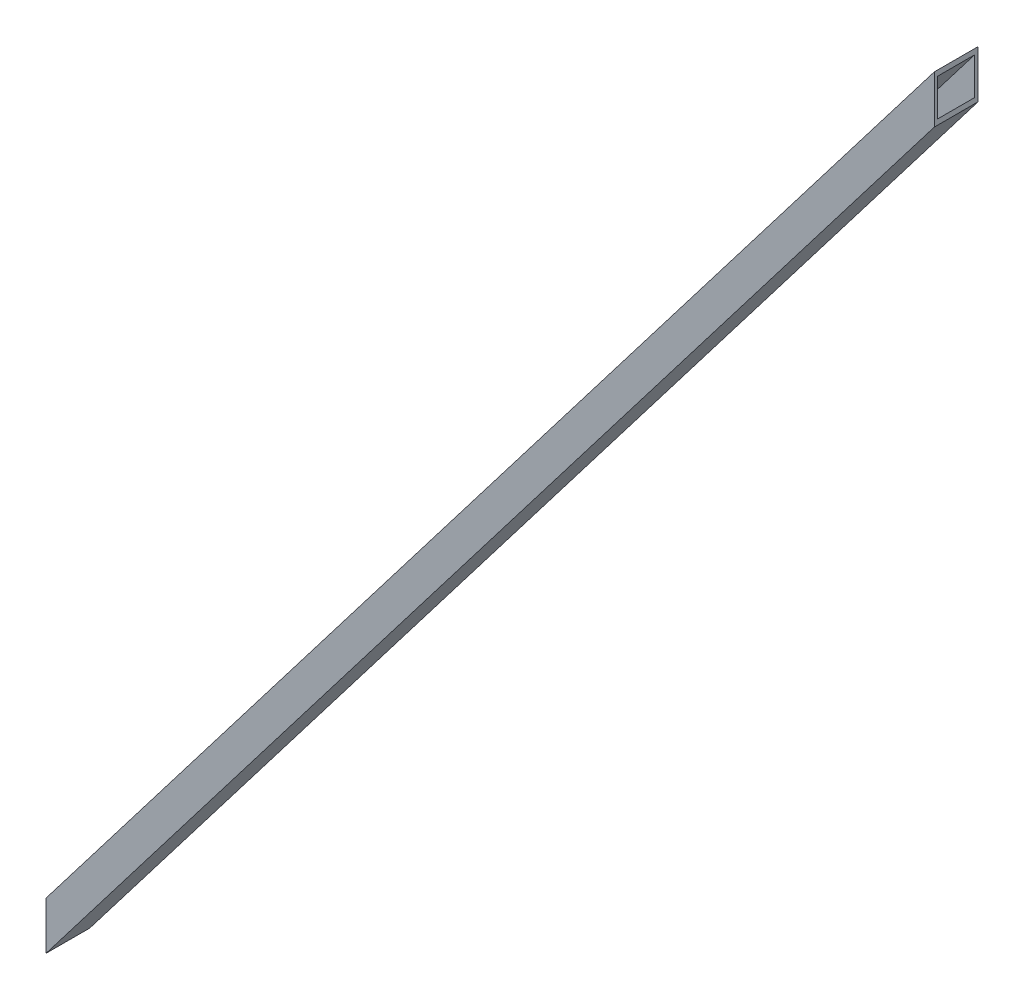
ISO-10303-21;
HEADER;
FILE_DESCRIPTION(('STEP AP214'),'2;1');
FILE_NAME('part.step','',(''),(''),'','','');
FILE_SCHEMA(('AUTOMOTIVE_DESIGN { 1 0 10303 214 1 1 1 1 }'));
ENDSEC;
DATA;
#1=APPLICATION_CONTEXT('core data for automotive mechanical design processes');
#2=APPLICATION_PROTOCOL_DEFINITION('international standard','automotive_design',2000,#1);
#3=PRODUCT_CONTEXT('',#1,'mechanical');
#4=PRODUCT('Part','Part','',(#3));
#5=PRODUCT_RELATED_PRODUCT_CATEGORY('part','',(#4));
#6=PRODUCT_DEFINITION_FORMATION('','',#4);
#7=PRODUCT_DEFINITION_CONTEXT('part definition',#1,'design');
#8=PRODUCT_DEFINITION('design','',#6,#7);
#9=PRODUCT_DEFINITION_SHAPE('','',#8);
#10=(LENGTH_UNIT() NAMED_UNIT(*) SI_UNIT(.MILLI.,.METRE.));
#11=(NAMED_UNIT(*) PLANE_ANGLE_UNIT() SI_UNIT($,.RADIAN.));
#12=(NAMED_UNIT(*) SI_UNIT($,.STERADIAN.) SOLID_ANGLE_UNIT());
#13=UNCERTAINTY_MEASURE_WITH_UNIT(LENGTH_MEASURE(1.E-05),#10,'distance_accuracy_value','');
#14=(GEOMETRIC_REPRESENTATION_CONTEXT(3) GLOBAL_UNCERTAINTY_ASSIGNED_CONTEXT((#13)) GLOBAL_UNIT_ASSIGNED_CONTEXT((#10,
#11,#12)) REPRESENTATION_CONTEXT('',''));
#15=CARTESIAN_POINT('',(0.,0.,0.));
#16=DIRECTION('',(0.,0.,1.));
#17=DIRECTION('',(1.,0.,0.));
#18=AXIS2_PLACEMENT_3D('',#15,#16,#17);
#19=CARTESIAN_POINT('',(0.,0.,0.));
#20=DIRECTION('',(1.,0.,0.));
#21=DIRECTION('',(0.,0.,-1.));
#22=AXIS2_PLACEMENT_3D('',#19,#20,#21);
#23=PLANE('',#22);
#24=DIRECTION('',(0.,-1.,0.));
#25=VECTOR('',#24,1.);
#26=CARTESIAN_POINT('',(0.,750.,-220.));
#27=LINE('',#26,#25);
#28=CARTESIAN_POINT('',(0.,750.,-220.));
#29=VERTEX_POINT('',#28);
#30=CARTESIAN_POINT('',(0.,720.,-220.));
#31=VERTEX_POINT('',#30);
#32=EDGE_CURVE('E131',#29,#31,#27,.T.);
#33=ORIENTED_EDGE('',*,*,#32,.F.);
#34=DIRECTION('',(0.,0.,-1.));
#35=VECTOR('',#34,1.);
#36=CARTESIAN_POINT('',(0.,750.,-220.));
#37=LINE('',#36,#35);
#38=CARTESIAN_POINT('',(0.,750.,-250.));
#39=VERTEX_POINT('',#38);
#40=EDGE_CURVE('E201',#29,#39,#37,.T.);
#41=ORIENTED_EDGE('',*,*,#40,.T.);
#42=DIRECTION('',(0.,-1.,0.));
#43=VECTOR('',#42,1.);
#44=CARTESIAN_POINT('',(0.,750.,-250.));
#45=LINE('',#44,#43);
#46=CARTESIAN_POINT('',(0.,720.,-250.));
#47=VERTEX_POINT('',#46);
#48=EDGE_CURVE('E59',#39,#47,#45,.T.);
#49=ORIENTED_EDGE('',*,*,#48,.T.);
#50=DIRECTION('',(0.,0.,-1.));
#51=VECTOR('',#50,1.);
#52=CARTESIAN_POINT('',(0.,720.,-220.));
#53=LINE('',#52,#51);
#54=EDGE_CURVE('E45',#31,#47,#53,.T.);
#55=ORIENTED_EDGE('',*,*,#54,.F.);
#56=EDGE_LOOP('',(#33,#41,#49,#55));
#57=FACE_BOUND('',#56,.T.);
#58=DIRECTION('',(0.,-1.,0.));
#59=VECTOR('',#58,1.);
#60=CARTESIAN_POINT('',(0.,0.,-217.26869994325));
#61=LINE('',#60,#59);
#62=CARTESIAN_POINT('',(0.,754.382921400162,-217.26869994325));
#63=VERTEX_POINT('',#62);
#64=CARTESIAN_POINT('',(0.,715.617078599838,-217.26869994325));
#65=VERTEX_POINT('',#64);
#66=EDGE_CURVE('E120',#63,#65,#61,.T.);
#67=ORIENTED_EDGE('',*,*,#66,.T.);
#68=DIRECTION('',(0.,0.,-1.));
#69=VECTOR('',#68,1.);
#70=CARTESIAN_POINT('',(0.,715.617078599837,0.));
#71=LINE('',#70,#69);
#72=CARTESIAN_POINT('',(0.,715.617078599838,-252.73130005675));
#73=VERTEX_POINT('',#72);
#74=EDGE_CURVE('E223',#65,#73,#71,.T.);
#75=ORIENTED_EDGE('',*,*,#74,.T.);
#76=DIRECTION('',(0.,-1.,0.));
#77=VECTOR('',#76,1.);
#78=CARTESIAN_POINT('',(0.,0.,-252.73130005675));
#79=LINE('',#78,#77);
#80=CARTESIAN_POINT('',(0.,754.382921400162,-252.73130005675));
#81=VERTEX_POINT('',#80);
#82=EDGE_CURVE('E220',#81,#73,#79,.T.);
#83=ORIENTED_EDGE('',*,*,#82,.F.);
#84=DIRECTION('',(0.,0.,-1.));
#85=VECTOR('',#84,1.);
#86=CARTESIAN_POINT('',(0.,754.382921400162,0.));
#87=LINE('',#86,#85);
#88=EDGE_CURVE('E215',#63,#81,#87,.T.);
#89=ORIENTED_EDGE('',*,*,#88,.F.);
#90=EDGE_LOOP('',(#67,#75,#83,#89));
#91=FACE_BOUND('',#90,.T.);
#92=ADVANCED_FACE('F41',(#57,#91),#23,.T.);
#93=CARTESIAN_POINT('',(-500.,0.,0.));
#94=DIRECTION('',(-1.,0.,0.));
#95=DIRECTION('',(0.,0.,1.));
#96=AXIS2_PLACEMENT_3D('',#93,#94,#95);
#97=PLANE('',#96);
#98=DIRECTION('',(0.,1.,0.));
#99=VECTOR('',#98,1.);
#100=CARTESIAN_POINT('',(-500.,0.,0.));
#101=LINE('',#100,#99);
#102=CARTESIAN_POINT('',(-500.,0.,0.));
#103=VERTEX_POINT('',#102);
#104=CARTESIAN_POINT('',(-500.,30.,0.));
#105=VERTEX_POINT('',#104);
#106=EDGE_CURVE('E127',#103,#105,#101,.T.);
#107=ORIENTED_EDGE('',*,*,#106,.F.);
#108=DIRECTION('',(0.,0.,-1.));
#109=VECTOR('',#108,1.);
#110=CARTESIAN_POINT('',(-500.,0.,0.));
#111=LINE('',#110,#109);
#112=CARTESIAN_POINT('',(-500.,0.,-30.));
#113=VERTEX_POINT('',#112);
#114=EDGE_CURVE('E109',#103,#113,#111,.T.);
#115=ORIENTED_EDGE('',*,*,#114,.T.);
#116=DIRECTION('',(0.,1.,0.));
#117=VECTOR('',#116,1.);
#118=CARTESIAN_POINT('',(-500.,0.,-30.));
#119=LINE('',#118,#117);
#120=CARTESIAN_POINT('',(-500.,30.,-30.));
#121=VERTEX_POINT('',#120);
#122=EDGE_CURVE('E65',#113,#121,#119,.T.);
#123=ORIENTED_EDGE('',*,*,#122,.T.);
#124=DIRECTION('',(0.,0.,-1.));
#125=VECTOR('',#124,1.);
#126=CARTESIAN_POINT('',(-500.,30.,0.));
#127=LINE('',#126,#125);
#128=EDGE_CURVE('E140',#105,#121,#127,.T.);
#129=ORIENTED_EDGE('',*,*,#128,.F.);
#130=EDGE_LOOP('',(#107,#115,#123,#129));
#131=FACE_BOUND('',#130,.T.);
#132=DIRECTION('',(0.,1.,0.));
#133=VECTOR('',#132,1.);
#134=CARTESIAN_POINT('',(-500.,0.,2.73130005674949));
#135=LINE('',#134,#133);
#136=CARTESIAN_POINT('',(-500.,-4.38292140016247,2.73130005674947));
#137=VERTEX_POINT('',#136);
#138=CARTESIAN_POINT('',(-500.,34.3829214001621,2.73130005674947));
#139=VERTEX_POINT('',#138);
#140=EDGE_CURVE('E211',#137,#139,#135,.T.);
#141=ORIENTED_EDGE('',*,*,#140,.T.);
#142=DIRECTION('',(0.,0.,-1.));
#143=VECTOR('',#142,1.);
#144=CARTESIAN_POINT('',(-500.,34.3829214001621,0.));
#145=LINE('',#144,#143);
#146=CARTESIAN_POINT('',(-500.,34.3829214001621,-32.7313000567496));
#147=VERTEX_POINT('',#146);
#148=EDGE_CURVE('E227',#139,#147,#145,.T.);
#149=ORIENTED_EDGE('',*,*,#148,.T.);
#150=DIRECTION('',(0.,1.,0.));
#151=VECTOR('',#150,1.);
#152=CARTESIAN_POINT('',(-500.,0.,-32.7313000567496));
#153=LINE('',#152,#151);
#154=CARTESIAN_POINT('',(-500.,-4.38292140016247,-32.7313000567496));
#155=VERTEX_POINT('',#154);
#156=EDGE_CURVE('E51',#155,#147,#153,.T.);
#157=ORIENTED_EDGE('',*,*,#156,.F.);
#158=DIRECTION('',(0.,0.,-1.));
#159=VECTOR('',#158,1.);
#160=CARTESIAN_POINT('',(-500.,-4.38292140016247,0.));
#161=LINE('',#160,#159);
#162=EDGE_CURVE('E12',#137,#155,#161,.T.);
#163=ORIENTED_EDGE('',*,*,#162,.F.);
#164=EDGE_LOOP('',(#141,#149,#157,#163));
#165=FACE_BOUND('',#164,.T.);
#166=ADVANCED_FACE('F137',(#131,#165),#97,.T.);
#167=CARTESIAN_POINT('',(-353.43291476322,245.439524141125,0.));
#168=DIRECTION('',(-0.821369965673296,0.570395809495344,0.));
#169=DIRECTION('',(-0.570395809495344,-0.821369965673296,0.));
#170=AXIS2_PLACEMENT_3D('',#167,#168,#169);
#171=PLANE('',#170);
#172=DIRECTION('',(0.55323817471572,0.796662971590637,-0.243424796874917));
#173=VECTOR('',#172,1.);
#174=CARTESIAN_POINT('',(-361.750010648648,233.462906066109,-58.0986952578453));
#175=LINE('',#174,#173);
#176=EDGE_CURVE('E205',#139,#63,#175,.T.);
#177=ORIENTED_EDGE('',*,*,#176,.T.);
#178=ORIENTED_EDGE('',*,*,#88,.T.);
#179=DIRECTION('',(0.55323817471572,0.796662971590637,-0.243424796874917));
#180=VECTOR('',#179,1.);
#181=CARTESIAN_POINT('',(-366.525826041015,226.585731901101,-91.4599365987031));
#182=LINE('',#181,#180);
#183=EDGE_CURVE('E208',#147,#81,#182,.T.);
#184=ORIENTED_EDGE('',*,*,#183,.F.);
#185=ORIENTED_EDGE('',*,*,#148,.F.);
#186=EDGE_LOOP('',(#177,#178,#184,#185));
#187=FACE_BOUND('',#186,.T.);
#188=ADVANCED_FACE('F163',(#187),#171,.T.);
#189=CARTESIAN_POINT('',(-93.1650234793648,0.,-211.738689725829));
#190=DIRECTION('',(-0.402738614266017,0.,-0.915315032422766));
#191=DIRECTION('',(-0.915315032422766,0.,0.402738614266017));
#192=AXIS2_PLACEMENT_3D('',#189,#190,#191);
#193=PLANE('',#192);
#194=ORIENTED_EDGE('',*,*,#183,.T.);
#195=ORIENTED_EDGE('',*,*,#82,.T.);
#196=DIRECTION('',(0.55323817471572,0.796662971590637,-0.243424796874917));
#197=VECTOR('',#196,1.);
#198=CARTESIAN_POINT('',(-349.439999145671,212.423479830071,-98.9777004326544));
#199=LINE('',#198,#197);
#200=EDGE_CURVE('E212',#155,#73,#199,.T.);
#201=ORIENTED_EDGE('',*,*,#200,.F.);
#202=ORIENTED_EDGE('',*,*,#156,.T.);
#203=EDGE_LOOP('',(#194,#195,#201,#202));
#204=FACE_BOUND('',#203,.T.);
#205=ADVANCED_FACE('F245',(#204),#193,.T.);
#206=CARTESIAN_POINT('',(-80.0923491747907,0.,-182.028066306343));
#207=DIRECTION('',(-0.402738614266017,0.,-0.915315032422766));
#208=DIRECTION('',(-0.915315032422766,0.,0.402738614266017));
#209=AXIS2_PLACEMENT_3D('',#206,#207,#208);
#210=PLANE('',#209);
#211=DIRECTION('',(0.55323817471572,0.796662971590637,-0.243424796874917));
#212=VECTOR('',#211,1.);
#213=CARTESIAN_POINT('',(-344.664183753304,219.300653995079,-65.6164590917966));
#214=LINE('',#213,#212);
#215=EDGE_CURVE('E209',#137,#65,#214,.T.);
#216=ORIENTED_EDGE('',*,*,#215,.T.);
#217=ORIENTED_EDGE('',*,*,#66,.F.);
#218=ORIENTED_EDGE('',*,*,#176,.F.);
#219=ORIENTED_EDGE('',*,*,#140,.F.);
#220=EDGE_LOOP('',(#216,#217,#218,#219));
#221=FACE_BOUND('',#220,.T.);
#222=ADVANCED_FACE('F237',(#221),#210,.F.);
#223=CARTESIAN_POINT('',(-335.270885340892,232.827003708953,0.));
#224=DIRECTION('',(-0.821369965673296,0.570395809495344,0.));
#225=DIRECTION('',(-0.570395809495344,-0.821369965673296,0.));
#226=AXIS2_PLACEMENT_3D('',#223,#224,#225);
#227=PLANE('',#226);
#228=ORIENTED_EDGE('',*,*,#200,.T.);
#229=ORIENTED_EDGE('',*,*,#74,.F.);
#230=ORIENTED_EDGE('',*,*,#215,.F.);
#231=ORIENTED_EDGE('',*,*,#162,.T.);
#232=EDGE_LOOP('',(#228,#229,#230,#231));
#233=FACE_BOUND('',#232,.T.);
#234=ADVANCED_FACE('F43',(#233),#227,.F.);
#235=CARTESIAN_POINT('',(-351.379489849037,244.013534617387,0.));
#236=DIRECTION('',(-0.821369965673296,0.570395809495344,0.));
#237=DIRECTION('',(-0.570395809495344,-0.821369965673296,0.));
#238=AXIS2_PLACEMENT_3D('',#235,#236,#237);
#239=PLANE('',#238);
#240=DIRECTION('',(0.55323817471572,0.796662971590637,-0.243424796874917));
#241=VECTOR('',#240,1.);
#242=CARTESIAN_POINT('',(-500.,30.,0.));
#243=LINE('',#242,#241);
#244=EDGE_CURVE('E134',#105,#29,#243,.T.);
#245=ORIENTED_EDGE('',*,*,#244,.F.);
#246=ORIENTED_EDGE('',*,*,#128,.T.);
#247=DIRECTION('',(0.55323817471572,0.796662971590637,-0.243424796874917));
#248=VECTOR('',#247,1.);
#249=CARTESIAN_POINT('',(-500.,30.,-30.));
#250=LINE('',#249,#248);
#251=EDGE_CURVE('E142',#121,#39,#250,.T.);
#252=ORIENTED_EDGE('',*,*,#251,.T.);
#253=ORIENTED_EDGE('',*,*,#40,.F.);
#254=EDGE_LOOP('',(#245,#246,#252,#253));
#255=FACE_BOUND('',#254,.T.);
#256=ADVANCED_FACE('F314',(#255),#239,.F.);
#257=CARTESIAN_POINT('',(-92.1581769436997,0.,-209.450402144772));
#258=DIRECTION('',(-0.402738614266017,0.,-0.915315032422766));
#259=DIRECTION('',(-0.915315032422766,0.,0.402738614266017));
#260=AXIS2_PLACEMENT_3D('',#257,#258,#259);
#261=PLANE('',#260);
#262=ORIENTED_EDGE('',*,*,#251,.F.);
#263=ORIENTED_EDGE('',*,*,#122,.F.);
#264=DIRECTION('',(0.55323817471572,0.796662971590637,-0.243424796874917));
#265=VECTOR('',#264,1.);
#266=CARTESIAN_POINT('',(-500.,0.,-30.));
#267=LINE('',#266,#265);
#268=EDGE_CURVE('E116',#113,#47,#267,.T.);
#269=ORIENTED_EDGE('',*,*,#268,.T.);
#270=ORIENTED_EDGE('',*,*,#48,.F.);
#271=EDGE_LOOP('',(#262,#263,#269,#270));
#272=FACE_BOUND('',#271,.T.);
#273=ADVANCED_FACE('F305',(#272),#261,.F.);
#274=CARTESIAN_POINT('',(-81.0991957104558,0.,-184.3163538874));
#275=DIRECTION('',(-0.402738614266017,0.,-0.915315032422766));
#276=DIRECTION('',(-0.915315032422766,0.,0.402738614266017));
#277=AXIS2_PLACEMENT_3D('',#274,#275,#276);
#278=PLANE('',#277);
#279=DIRECTION('',(0.55323817471572,0.796662971590637,-0.243424796874917));
#280=VECTOR('',#279,1.);
#281=CARTESIAN_POINT('',(-500.,0.,0.));
#282=LINE('',#281,#280);
#283=EDGE_CURVE('E114',#103,#31,#282,.T.);
#284=ORIENTED_EDGE('',*,*,#283,.F.);
#285=ORIENTED_EDGE('',*,*,#106,.T.);
#286=ORIENTED_EDGE('',*,*,#244,.T.);
#287=ORIENTED_EDGE('',*,*,#32,.T.);
#288=EDGE_LOOP('',(#284,#285,#286,#287));
#289=FACE_BOUND('',#288,.T.);
#290=ADVANCED_FACE('F125',(#289),#278,.T.);
#291=CARTESIAN_POINT('',(-337.324310255075,234.252993232691,0.));
#292=DIRECTION('',(-0.821369965673296,0.570395809495344,0.));
#293=DIRECTION('',(-0.570395809495344,-0.821369965673296,0.));
#294=AXIS2_PLACEMENT_3D('',#291,#292,#293);
#295=PLANE('',#294);
#296=ORIENTED_EDGE('',*,*,#268,.F.);
#297=ORIENTED_EDGE('',*,*,#114,.F.);
#298=ORIENTED_EDGE('',*,*,#283,.T.);
#299=ORIENTED_EDGE('',*,*,#54,.T.);
#300=EDGE_LOOP('',(#296,#297,#298,#299));
#301=FACE_BOUND('',#300,.T.);
#302=ADVANCED_FACE('F112',(#301),#295,.T.);
#303=CLOSED_SHELL('',(#92,#166,#188,#205,#222,#234,#256,#273,#290,#302));
#304=MANIFOLD_SOLID_BREP('B2',#303);
#305=ADVANCED_BREP_SHAPE_REPRESENTATION('',(#18,#304),#14);
#306=SHAPE_DEFINITION_REPRESENTATION(#9,#305);
ENDSEC;
END-ISO-10303-21;
